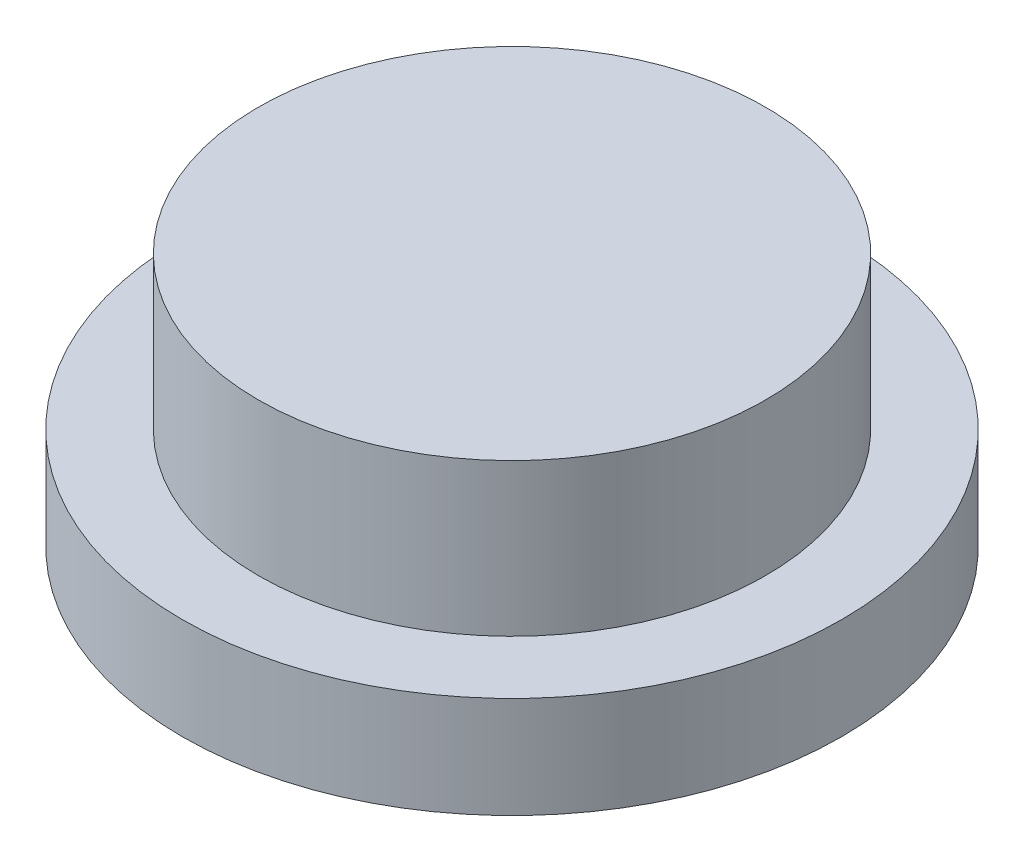
ISO-10303-21;
HEADER;
FILE_DESCRIPTION(('STEP AP214'),'2;1');
FILE_NAME('part.step','',(''),(''),'','','');
FILE_SCHEMA(('AUTOMOTIVE_DESIGN { 1 0 10303 214 1 1 1 1 }'));
ENDSEC;
DATA;
#1=APPLICATION_CONTEXT('core data for automotive mechanical design processes');
#2=APPLICATION_PROTOCOL_DEFINITION('international standard','automotive_design',2000,#1);
#3=PRODUCT_CONTEXT('',#1,'mechanical');
#4=PRODUCT('Part','Part','',(#3));
#5=PRODUCT_RELATED_PRODUCT_CATEGORY('part','',(#4));
#6=PRODUCT_DEFINITION_FORMATION('','',#4);
#7=PRODUCT_DEFINITION_CONTEXT('part definition',#1,'design');
#8=PRODUCT_DEFINITION('design','',#6,#7);
#9=PRODUCT_DEFINITION_SHAPE('','',#8);
#10=(LENGTH_UNIT() NAMED_UNIT(*) SI_UNIT(.MILLI.,.METRE.));
#11=(NAMED_UNIT(*) PLANE_ANGLE_UNIT() SI_UNIT($,.RADIAN.));
#12=(NAMED_UNIT(*) SI_UNIT($,.STERADIAN.) SOLID_ANGLE_UNIT());
#13=UNCERTAINTY_MEASURE_WITH_UNIT(LENGTH_MEASURE(1.E-05),#10,'distance_accuracy_value','');
#14=(GEOMETRIC_REPRESENTATION_CONTEXT(3) GLOBAL_UNCERTAINTY_ASSIGNED_CONTEXT((#13)) GLOBAL_UNIT_ASSIGNED_CONTEXT((#10,
#11,#12)) REPRESENTATION_CONTEXT('',''));
#15=CARTESIAN_POINT('',(0.,0.,0.));
#16=DIRECTION('',(0.,0.,1.));
#17=DIRECTION('',(1.,0.,0.));
#18=AXIS2_PLACEMENT_3D('',#15,#16,#17);
#19=CARTESIAN_POINT('',(0.,10.,0.));
#20=DIRECTION('',(0.,-1.,0.));
#21=DIRECTION('',(0.,0.,-1.));
#22=AXIS2_PLACEMENT_3D('',#19,#20,#21);
#23=PLANE('',#22);
#24=CARTESIAN_POINT('',(0.,10.,0.));
#25=DIRECTION('',(0.,1.,0.));
#26=DIRECTION('',(0.,0.,1.));
#27=AXIS2_PLACEMENT_3D('',#24,#25,#26);
#28=CIRCLE('',#27,10.);
#29=CARTESIAN_POINT('',(0.,10.,10.));
#30=VERTEX_POINT('',#29);
#31=EDGE_CURVE('E10',#30,#30,#28,.T.);
#32=ORIENTED_EDGE('',*,*,#31,.T.);
#33=EDGE_LOOP('',(#32));
#34=FACE_BOUND('',#33,.T.);
#35=ADVANCED_FACE('F37',(#34),#23,.F.);
#36=CARTESIAN_POINT('',(0.,57.5392613884896,0.));
#37=DIRECTION('',(0.,1.,0.));
#38=DIRECTION('',(0.,0.,1.));
#39=AXIS2_PLACEMENT_3D('',#36,#37,#38);
#40=CYLINDRICAL_SURFACE('',#39,10.);
#41=ORIENTED_EDGE('',*,*,#31,.F.);
#42=EDGE_LOOP('',(#41));
#43=FACE_BOUND('',#42,.T.);
#44=CARTESIAN_POINT('',(0.,4.,0.));
#45=DIRECTION('',(0.,1.,0.));
#46=DIRECTION('',(0.,0.,1.));
#47=AXIS2_PLACEMENT_3D('',#44,#45,#46);
#48=CIRCLE('',#47,10.);
#49=CARTESIAN_POINT('',(0.,4.,10.));
#50=VERTEX_POINT('',#49);
#51=EDGE_CURVE('E44',#50,#50,#48,.T.);
#52=ORIENTED_EDGE('',*,*,#51,.T.);
#53=EDGE_LOOP('',(#52));
#54=FACE_BOUND('',#53,.T.);
#55=ADVANCED_FACE('F73',(#43,#54),#40,.T.);
#56=CARTESIAN_POINT('',(0.,4.,-10.));
#57=DIRECTION('',(0.,-1.,0.));
#58=DIRECTION('',(0.,0.,-1.));
#59=AXIS2_PLACEMENT_3D('',#56,#57,#58);
#60=PLANE('',#59);
#61=ORIENTED_EDGE('',*,*,#51,.F.);
#62=EDGE_LOOP('',(#61));
#63=FACE_BOUND('',#62,.T.);
#64=CARTESIAN_POINT('',(0.,4.,0.));
#65=DIRECTION('',(0.,1.,0.));
#66=DIRECTION('',(0.,0.,1.));
#67=AXIS2_PLACEMENT_3D('',#64,#65,#66);
#68=CIRCLE('',#67,13.);
#69=CARTESIAN_POINT('',(0.,4.,13.));
#70=VERTEX_POINT('',#69);
#71=EDGE_CURVE('E49',#70,#70,#68,.T.);
#72=ORIENTED_EDGE('',*,*,#71,.T.);
#73=EDGE_LOOP('',(#72));
#74=FACE_BOUND('',#73,.T.);
#75=ADVANCED_FACE('F69',(#63,#74),#60,.F.);
#76=CARTESIAN_POINT('',(0.,57.5392613884896,0.));
#77=DIRECTION('',(0.,1.,0.));
#78=DIRECTION('',(0.,0.,1.));
#79=AXIS2_PLACEMENT_3D('',#76,#77,#78);
#80=CYLINDRICAL_SURFACE('',#79,13.);
#81=ORIENTED_EDGE('',*,*,#71,.F.);
#82=EDGE_LOOP('',(#81));
#83=FACE_BOUND('',#82,.T.);
#84=CARTESIAN_POINT('',(0.,0.,0.));
#85=DIRECTION('',(0.,1.,0.));
#86=DIRECTION('',(0.,0.,1.));
#87=AXIS2_PLACEMENT_3D('',#84,#85,#86);
#88=CIRCLE('',#87,13.);
#89=CARTESIAN_POINT('',(0.,0.,13.));
#90=VERTEX_POINT('',#89);
#91=EDGE_CURVE('E54',#90,#90,#88,.T.);
#92=ORIENTED_EDGE('',*,*,#91,.T.);
#93=EDGE_LOOP('',(#92));
#94=FACE_BOUND('',#93,.T.);
#95=ADVANCED_FACE('F61',(#83,#94),#80,.T.);
#96=CARTESIAN_POINT('',(0.,0.,-13.));
#97=DIRECTION('',(0.,1.,0.));
#98=DIRECTION('',(0.,0.,1.));
#99=AXIS2_PLACEMENT_3D('',#96,#97,#98);
#100=PLANE('',#99);
#101=ORIENTED_EDGE('',*,*,#91,.F.);
#102=EDGE_LOOP('',(#101));
#103=FACE_BOUND('',#102,.T.);
#104=ADVANCED_FACE('F63',(#103),#100,.F.);
#105=CLOSED_SHELL('',(#35,#55,#75,#95,#104));
#106=MANIFOLD_SOLID_BREP('B2',#105);
#107=ADVANCED_BREP_SHAPE_REPRESENTATION('',(#18,#106),#14);
#108=SHAPE_DEFINITION_REPRESENTATION(#9,#107);
ENDSEC;
END-ISO-10303-21;
